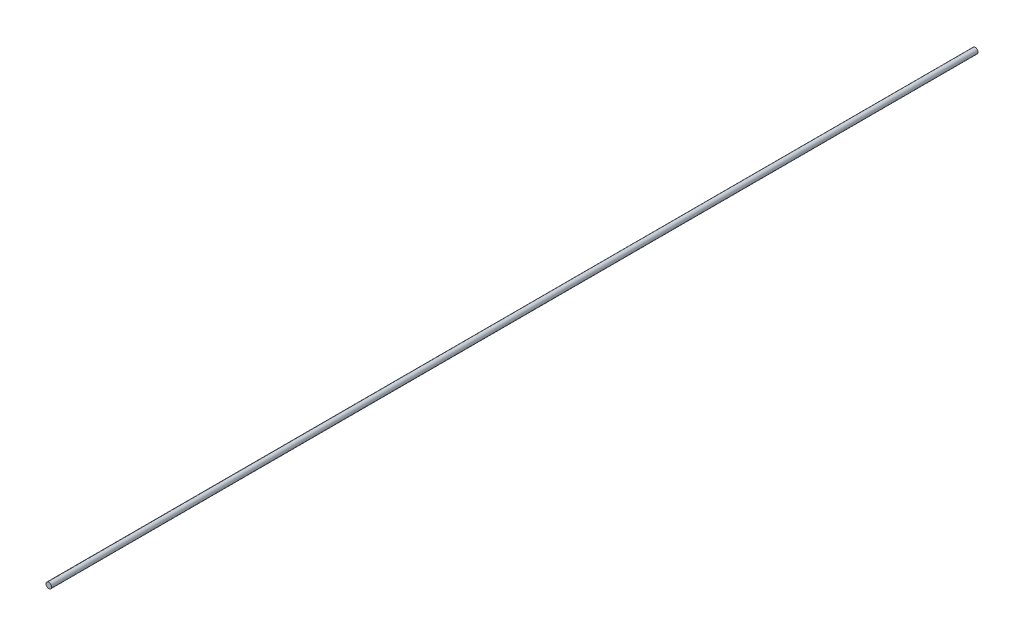
ISO-10303-21;
HEADER;
FILE_DESCRIPTION(('STEP AP214'),'2;1');
FILE_NAME('part.step','',(''),(''),'','','');
FILE_SCHEMA(('AUTOMOTIVE_DESIGN { 1 0 10303 214 1 1 1 1 }'));
ENDSEC;
DATA;
#1=APPLICATION_CONTEXT('core data for automotive mechanical design processes');
#2=APPLICATION_PROTOCOL_DEFINITION('international standard','automotive_design',2000,#1);
#3=PRODUCT_CONTEXT('',#1,'mechanical');
#4=PRODUCT('Part','Part','',(#3));
#5=PRODUCT_RELATED_PRODUCT_CATEGORY('part','',(#4));
#6=PRODUCT_DEFINITION_FORMATION('','',#4);
#7=PRODUCT_DEFINITION_CONTEXT('part definition',#1,'design');
#8=PRODUCT_DEFINITION('design','',#6,#7);
#9=PRODUCT_DEFINITION_SHAPE('','',#8);
#10=(LENGTH_UNIT() NAMED_UNIT(*) SI_UNIT(.MILLI.,.METRE.));
#11=(NAMED_UNIT(*) PLANE_ANGLE_UNIT() SI_UNIT($,.RADIAN.));
#12=(NAMED_UNIT(*) SI_UNIT($,.STERADIAN.) SOLID_ANGLE_UNIT());
#13=UNCERTAINTY_MEASURE_WITH_UNIT(LENGTH_MEASURE(1.E-05),#10,'distance_accuracy_value','');
#14=(GEOMETRIC_REPRESENTATION_CONTEXT(3) GLOBAL_UNCERTAINTY_ASSIGNED_CONTEXT((#13)) GLOBAL_UNIT_ASSIGNED_CONTEXT((#10,
#11,#12)) REPRESENTATION_CONTEXT('',''));
#15=CARTESIAN_POINT('',(0.,0.,0.));
#16=DIRECTION('',(0.,0.,1.));
#17=DIRECTION('',(1.,0.,0.));
#18=AXIS2_PLACEMENT_3D('',#15,#16,#17);
#19=CARTESIAN_POINT('',(0.,0.,1000.));
#20=DIRECTION('',(0.,0.,-1.));
#21=DIRECTION('',(-1.,0.,0.));
#22=AXIS2_PLACEMENT_3D('',#19,#20,#21);
#23=CYLINDRICAL_SURFACE('',#22,6.);
#24=CARTESIAN_POINT('',(0.,0.,1000.));
#25=DIRECTION('',(0.,0.,1.));
#26=DIRECTION('',(1.,0.,0.));
#27=AXIS2_PLACEMENT_3D('',#24,#25,#26);
#28=CIRCLE('',#27,6.);
#29=CARTESIAN_POINT('',(6.,0.,1000.));
#30=VERTEX_POINT('',#29);
#31=EDGE_CURVE('E10',#30,#30,#28,.T.);
#32=ORIENTED_EDGE('',*,*,#31,.F.);
#33=EDGE_LOOP('',(#32));
#34=FACE_BOUND('',#33,.T.);
#35=CARTESIAN_POINT('',(0.,0.,-1000.));
#36=DIRECTION('',(0.,0.,1.));
#37=DIRECTION('',(1.,0.,0.));
#38=AXIS2_PLACEMENT_3D('',#35,#36,#37);
#39=CIRCLE('',#38,6.);
#40=CARTESIAN_POINT('',(6.,0.,-1000.));
#41=VERTEX_POINT('',#40);
#42=EDGE_CURVE('E41',#41,#41,#39,.T.);
#43=ORIENTED_EDGE('',*,*,#42,.T.);
#44=EDGE_LOOP('',(#43));
#45=FACE_BOUND('',#44,.T.);
#46=ADVANCED_FACE('F38',(#34,#45),#23,.T.);
#47=CARTESIAN_POINT('',(0.,0.,1000.));
#48=DIRECTION('',(0.,0.,1.));
#49=DIRECTION('',(1.,0.,0.));
#50=AXIS2_PLACEMENT_3D('',#47,#48,#49);
#51=PLANE('',#50);
#52=ORIENTED_EDGE('',*,*,#31,.T.);
#53=EDGE_LOOP('',(#52));
#54=FACE_BOUND('',#53,.T.);
#55=ADVANCED_FACE('F53',(#54),#51,.T.);
#56=CARTESIAN_POINT('',(0.,0.,-1000.));
#57=DIRECTION('',(0.,0.,1.));
#58=DIRECTION('',(1.,0.,0.));
#59=AXIS2_PLACEMENT_3D('',#56,#57,#58);
#60=PLANE('',#59);
#61=ORIENTED_EDGE('',*,*,#42,.F.);
#62=EDGE_LOOP('',(#61));
#63=FACE_BOUND('',#62,.T.);
#64=ADVANCED_FACE('F51',(#63),#60,.F.);
#65=CLOSED_SHELL('',(#46,#55,#64));
#66=MANIFOLD_SOLID_BREP('B2',#65);
#67=ADVANCED_BREP_SHAPE_REPRESENTATION('',(#18,#66),#14);
#68=SHAPE_DEFINITION_REPRESENTATION(#9,#67);
ENDSEC;
END-ISO-10303-21;
